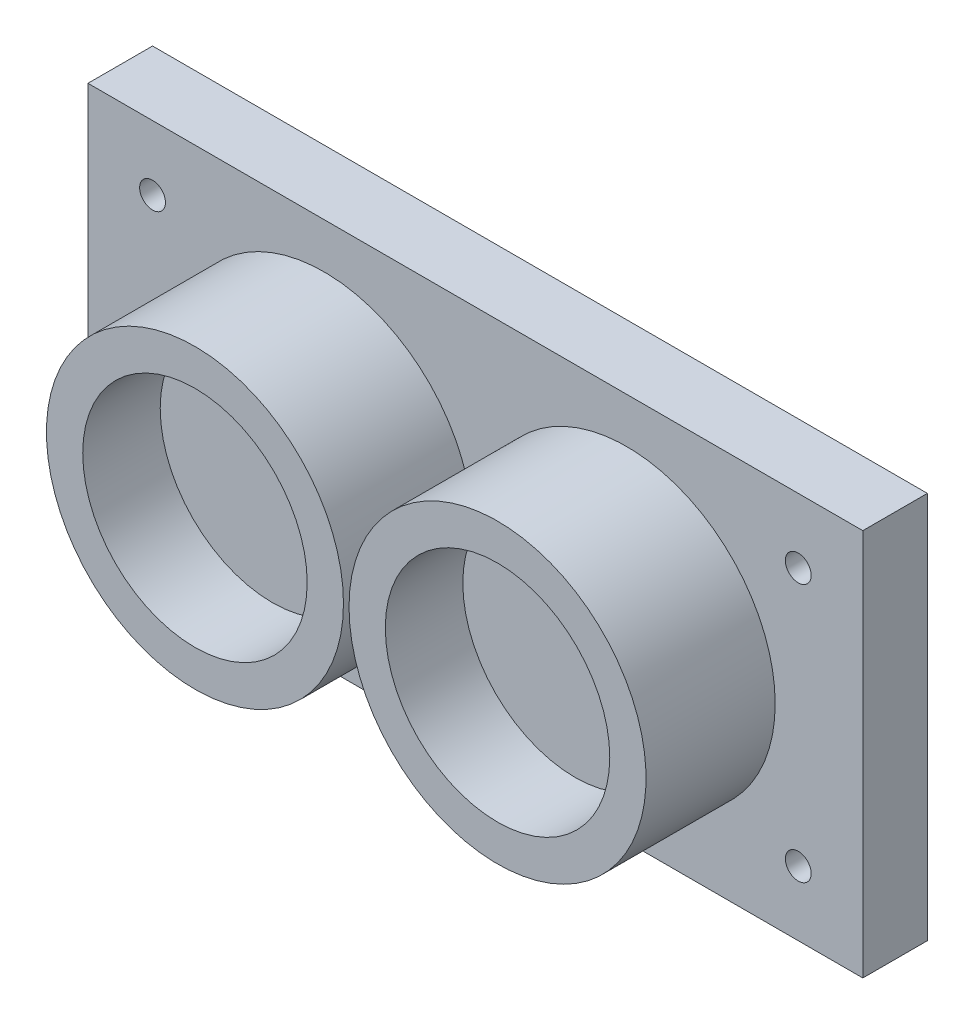
ISO-10303-21;
HEADER;
FILE_DESCRIPTION(('STEP AP214'),'2;1');
FILE_NAME('part.step','',(''),(''),'','','');
FILE_SCHEMA(('AUTOMOTIVE_DESIGN { 1 0 10303 214 1 1 1 1 }'));
ENDSEC;
DATA;
#1=APPLICATION_CONTEXT('core data for automotive mechanical design processes');
#2=APPLICATION_PROTOCOL_DEFINITION('international standard','automotive_design',2000,#1);
#3=PRODUCT_CONTEXT('',#1,'mechanical');
#4=PRODUCT('Part','Part','',(#3));
#5=PRODUCT_RELATED_PRODUCT_CATEGORY('part','',(#4));
#6=PRODUCT_DEFINITION_FORMATION('','',#4);
#7=PRODUCT_DEFINITION_CONTEXT('part definition',#1,'design');
#8=PRODUCT_DEFINITION('design','',#6,#7);
#9=PRODUCT_DEFINITION_SHAPE('','',#8);
#10=(LENGTH_UNIT() NAMED_UNIT(*) SI_UNIT(.MILLI.,.METRE.));
#11=(NAMED_UNIT(*) PLANE_ANGLE_UNIT() SI_UNIT($,.RADIAN.));
#12=(NAMED_UNIT(*) SI_UNIT($,.STERADIAN.) SOLID_ANGLE_UNIT());
#13=UNCERTAINTY_MEASURE_WITH_UNIT(LENGTH_MEASURE(1.E-05),#10,'distance_accuracy_value','');
#14=(GEOMETRIC_REPRESENTATION_CONTEXT(3) GLOBAL_UNCERTAINTY_ASSIGNED_CONTEXT((#13)) GLOBAL_UNIT_ASSIGNED_CONTEXT((#10,
#11,#12)) REPRESENTATION_CONTEXT('',''));
#15=CARTESIAN_POINT('',(0.,0.,0.));
#16=DIRECTION('',(0.,0.,1.));
#17=DIRECTION('',(1.,0.,0.));
#18=AXIS2_PLACEMENT_3D('',#15,#16,#17);
#19=CARTESIAN_POINT('',(0.,0.,5.));
#20=DIRECTION('',(0.,0.,1.));
#21=DIRECTION('',(1.,0.,0.));
#22=AXIS2_PLACEMENT_3D('',#19,#20,#21);
#23=PLANE('',#22);
#24=CARTESIAN_POINT('',(25.,10.,5.));
#25=DIRECTION('',(0.,0.,-1.));
#26=DIRECTION('',(-1.,0.,0.));
#27=AXIS2_PLACEMENT_3D('',#24,#25,#26);
#28=CIRCLE('',#27,1.);
#29=CARTESIAN_POINT('',(24.,10.,5.));
#30=VERTEX_POINT('',#29);
#31=EDGE_CURVE('E240',#30,#30,#28,.T.);
#32=ORIENTED_EDGE('',*,*,#31,.T.);
#33=EDGE_LOOP('',(#32));
#34=FACE_BOUND('',#33,.T.);
#35=CARTESIAN_POINT('',(25.,-10.,5.));
#36=DIRECTION('',(0.,0.,1.));
#37=DIRECTION('',(1.,0.,0.));
#38=AXIS2_PLACEMENT_3D('',#35,#36,#37);
#39=CIRCLE('',#38,1.);
#40=CARTESIAN_POINT('',(26.,-10.,5.));
#41=VERTEX_POINT('',#40);
#42=EDGE_CURVE('E118',#41,#41,#39,.T.);
#43=ORIENTED_EDGE('',*,*,#42,.F.);
#44=EDGE_LOOP('',(#43));
#45=FACE_BOUND('',#44,.T.);
#46=CARTESIAN_POINT('',(11.715,0.,5.));
#47=DIRECTION('',(0.,0.,1.));
#48=DIRECTION('',(1.,0.,0.));
#49=AXIS2_PLACEMENT_3D('',#46,#47,#48);
#50=CIRCLE('',#49,11.5);
#51=CARTESIAN_POINT('',(23.215,0.,5.));
#52=VERTEX_POINT('',#51);
#53=EDGE_CURVE('E11',#52,#52,#50,.T.);
#54=ORIENTED_EDGE('',*,*,#53,.F.);
#55=EDGE_LOOP('',(#54));
#56=FACE_BOUND('',#55,.T.);
#57=CARTESIAN_POINT('',(-11.715,0.,5.));
#58=DIRECTION('',(0.,0.,1.));
#59=DIRECTION('',(1.,0.,0.));
#60=AXIS2_PLACEMENT_3D('',#57,#58,#59);
#61=CIRCLE('',#60,11.5);
#62=CARTESIAN_POINT('',(-0.214999999999996,0.,5.));
#63=VERTEX_POINT('',#62);
#64=EDGE_CURVE('E141',#63,#63,#61,.T.);
#65=ORIENTED_EDGE('',*,*,#64,.F.);
#66=EDGE_LOOP('',(#65));
#67=FACE_BOUND('',#66,.T.);
#68=DIRECTION('',(0.,-1.,0.));
#69=VECTOR('',#68,1.);
#70=CARTESIAN_POINT('',(-30.,-15.,5.));
#71=LINE('',#70,#69);
#72=CARTESIAN_POINT('',(-30.,15.,5.));
#73=VERTEX_POINT('',#72);
#74=CARTESIAN_POINT('',(-30.,-15.,5.));
#75=VERTEX_POINT('',#74);
#76=EDGE_CURVE('E90',#73,#75,#71,.T.);
#77=ORIENTED_EDGE('',*,*,#76,.T.);
#78=DIRECTION('',(1.,0.,0.));
#79=VECTOR('',#78,1.);
#80=CARTESIAN_POINT('',(30.,-15.,5.));
#81=LINE('',#80,#79);
#82=CARTESIAN_POINT('',(30.,-15.,5.));
#83=VERTEX_POINT('',#82);
#84=EDGE_CURVE('E85',#75,#83,#81,.T.);
#85=ORIENTED_EDGE('',*,*,#84,.T.);
#86=DIRECTION('',(0.,1.,0.));
#87=VECTOR('',#86,1.);
#88=CARTESIAN_POINT('',(30.,-15.,5.));
#89=LINE('',#88,#87);
#90=CARTESIAN_POINT('',(30.,15.,5.));
#91=VERTEX_POINT('',#90);
#92=EDGE_CURVE('E88',#83,#91,#89,.T.);
#93=ORIENTED_EDGE('',*,*,#92,.T.);
#94=DIRECTION('',(-1.,0.,0.));
#95=VECTOR('',#94,1.);
#96=CARTESIAN_POINT('',(30.,15.,5.));
#97=LINE('',#96,#95);
#98=EDGE_CURVE('E54',#91,#73,#97,.T.);
#99=ORIENTED_EDGE('',*,*,#98,.T.);
#100=EDGE_LOOP('',(#77,#85,#93,#99));
#101=FACE_BOUND('',#100,.T.);
#102=CARTESIAN_POINT('',(-25.,10.,5.));
#103=DIRECTION('',(0.,0.,1.));
#104=DIRECTION('',(1.,0.,0.));
#105=AXIS2_PLACEMENT_3D('',#102,#103,#104);
#106=CIRCLE('',#105,1.);
#107=CARTESIAN_POINT('',(-24.,10.,5.));
#108=VERTEX_POINT('',#107);
#109=EDGE_CURVE('E244',#108,#108,#106,.T.);
#110=ORIENTED_EDGE('',*,*,#109,.F.);
#111=EDGE_LOOP('',(#110));
#112=FACE_BOUND('',#111,.T.);
#113=CARTESIAN_POINT('',(-25.,-10.,5.));
#114=DIRECTION('',(0.,0.,-1.));
#115=DIRECTION('',(-1.,0.,0.));
#116=AXIS2_PLACEMENT_3D('',#113,#114,#115);
#117=CIRCLE('',#116,1.);
#118=CARTESIAN_POINT('',(-26.,-10.,5.));
#119=VERTEX_POINT('',#118);
#120=EDGE_CURVE('E241',#119,#119,#117,.T.);
#121=ORIENTED_EDGE('',*,*,#120,.T.);
#122=EDGE_LOOP('',(#121));
#123=FACE_BOUND('',#122,.T.);
#124=ADVANCED_FACE('F35',(#34,#45,#56,#67,#101,#112,#123),#23,.T.);
#125=CARTESIAN_POINT('',(0.,0.,0.));
#126=DIRECTION('',(0.,0.,1.));
#127=DIRECTION('',(1.,0.,0.));
#128=AXIS2_PLACEMENT_3D('',#125,#126,#127);
#129=PLANE('',#128);
#130=CARTESIAN_POINT('',(-25.,10.,0.));
#131=DIRECTION('',(0.,0.,1.));
#132=DIRECTION('',(1.,0.,0.));
#133=AXIS2_PLACEMENT_3D('',#130,#131,#132);
#134=CIRCLE('',#133,1.);
#135=CARTESIAN_POINT('',(-24.,10.,0.));
#136=VERTEX_POINT('',#135);
#137=EDGE_CURVE('E120',#136,#136,#134,.T.);
#138=ORIENTED_EDGE('',*,*,#137,.T.);
#139=EDGE_LOOP('',(#138));
#140=FACE_BOUND('',#139,.T.);
#141=CARTESIAN_POINT('',(25.,-10.,0.));
#142=DIRECTION('',(0.,0.,1.));
#143=DIRECTION('',(1.,0.,0.));
#144=AXIS2_PLACEMENT_3D('',#141,#142,#143);
#145=CIRCLE('',#144,1.);
#146=CARTESIAN_POINT('',(26.,-10.,0.));
#147=VERTEX_POINT('',#146);
#148=EDGE_CURVE('E114',#147,#147,#145,.T.);
#149=ORIENTED_EDGE('',*,*,#148,.T.);
#150=EDGE_LOOP('',(#149));
#151=FACE_BOUND('',#150,.T.);
#152=DIRECTION('',(0.,-1.,0.));
#153=VECTOR('',#152,1.);
#154=CARTESIAN_POINT('',(-30.,-15.,0.));
#155=LINE('',#154,#153);
#156=CARTESIAN_POINT('',(-30.,15.,0.));
#157=VERTEX_POINT('',#156);
#158=CARTESIAN_POINT('',(-30.,-15.,0.));
#159=VERTEX_POINT('',#158);
#160=EDGE_CURVE('E104',#157,#159,#155,.T.);
#161=ORIENTED_EDGE('',*,*,#160,.F.);
#162=DIRECTION('',(-1.,0.,0.));
#163=VECTOR('',#162,1.);
#164=CARTESIAN_POINT('',(30.,15.,0.));
#165=LINE('',#164,#163);
#166=CARTESIAN_POINT('',(30.,15.,0.));
#167=VERTEX_POINT('',#166);
#168=EDGE_CURVE('E77',#167,#157,#165,.T.);
#169=ORIENTED_EDGE('',*,*,#168,.F.);
#170=DIRECTION('',(0.,1.,0.));
#171=VECTOR('',#170,1.);
#172=CARTESIAN_POINT('',(30.,-15.,0.));
#173=LINE('',#172,#171);
#174=CARTESIAN_POINT('',(30.,-15.,0.));
#175=VERTEX_POINT('',#174);
#176=EDGE_CURVE('E71',#175,#167,#173,.T.);
#177=ORIENTED_EDGE('',*,*,#176,.F.);
#178=DIRECTION('',(1.,0.,0.));
#179=VECTOR('',#178,1.);
#180=CARTESIAN_POINT('',(30.,-15.,0.));
#181=LINE('',#180,#179);
#182=EDGE_CURVE('E95',#159,#175,#181,.T.);
#183=ORIENTED_EDGE('',*,*,#182,.F.);
#184=EDGE_LOOP('',(#161,#169,#177,#183));
#185=FACE_BOUND('',#184,.T.);
#186=CARTESIAN_POINT('',(25.,10.,0.));
#187=DIRECTION('',(0.,0.,1.));
#188=DIRECTION('',(1.,0.,0.));
#189=AXIS2_PLACEMENT_3D('',#186,#187,#188);
#190=CIRCLE('',#189,1.);
#191=CARTESIAN_POINT('',(26.,10.,0.));
#192=VERTEX_POINT('',#191);
#193=EDGE_CURVE('E117',#192,#192,#190,.F.);
#194=ORIENTED_EDGE('',*,*,#193,.F.);
#195=EDGE_LOOP('',(#194));
#196=FACE_BOUND('',#195,.T.);
#197=CARTESIAN_POINT('',(-25.,-10.,0.));
#198=DIRECTION('',(0.,0.,1.));
#199=DIRECTION('',(1.,0.,0.));
#200=AXIS2_PLACEMENT_3D('',#197,#198,#199);
#201=CIRCLE('',#200,1.);
#202=CARTESIAN_POINT('',(-24.,-10.,0.));
#203=VERTEX_POINT('',#202);
#204=EDGE_CURVE('E39',#203,#203,#201,.F.);
#205=ORIENTED_EDGE('',*,*,#204,.F.);
#206=EDGE_LOOP('',(#205));
#207=FACE_BOUND('',#206,.T.);
#208=ADVANCED_FACE('F151',(#140,#151,#185,#196,#207),#129,.F.);
#209=CARTESIAN_POINT('',(-30.,-15.,5.));
#210=DIRECTION('',(1.,0.,0.));
#211=DIRECTION('',(0.,0.,-1.));
#212=AXIS2_PLACEMENT_3D('',#209,#210,#211);
#213=PLANE('',#212);
#214=ORIENTED_EDGE('',*,*,#160,.T.);
#215=DIRECTION('',(0.,0.,-1.));
#216=VECTOR('',#215,1.);
#217=CARTESIAN_POINT('',(-30.,-15.,5.));
#218=LINE('',#217,#216);
#219=EDGE_CURVE('E45',#75,#159,#218,.T.);
#220=ORIENTED_EDGE('',*,*,#219,.F.);
#221=ORIENTED_EDGE('',*,*,#76,.F.);
#222=DIRECTION('',(0.,0.,-1.));
#223=VECTOR('',#222,1.);
#224=CARTESIAN_POINT('',(-30.,15.,5.));
#225=LINE('',#224,#223);
#226=EDGE_CURVE('E100',#73,#157,#225,.T.);
#227=ORIENTED_EDGE('',*,*,#226,.T.);
#228=EDGE_LOOP('',(#214,#220,#221,#227));
#229=FACE_BOUND('',#228,.T.);
#230=ADVANCED_FACE('F37',(#229),#213,.F.);
#231=CARTESIAN_POINT('',(30.,-15.,5.));
#232=DIRECTION('',(0.,1.,0.));
#233=DIRECTION('',(-1.,0.,0.));
#234=AXIS2_PLACEMENT_3D('',#231,#232,#233);
#235=PLANE('',#234);
#236=ORIENTED_EDGE('',*,*,#182,.T.);
#237=DIRECTION('',(0.,0.,-1.));
#238=VECTOR('',#237,1.);
#239=CARTESIAN_POINT('',(30.,-15.,5.));
#240=LINE('',#239,#238);
#241=EDGE_CURVE('E93',#83,#175,#240,.T.);
#242=ORIENTED_EDGE('',*,*,#241,.F.);
#243=ORIENTED_EDGE('',*,*,#84,.F.);
#244=ORIENTED_EDGE('',*,*,#219,.T.);
#245=EDGE_LOOP('',(#236,#242,#243,#244));
#246=FACE_BOUND('',#245,.T.);
#247=ADVANCED_FACE('F94',(#246),#235,.F.);
#248=CARTESIAN_POINT('',(30.,-15.,5.));
#249=DIRECTION('',(-1.,0.,0.));
#250=DIRECTION('',(0.,0.,1.));
#251=AXIS2_PLACEMENT_3D('',#248,#249,#250);
#252=PLANE('',#251);
#253=ORIENTED_EDGE('',*,*,#176,.T.);
#254=DIRECTION('',(0.,0.,-1.));
#255=VECTOR('',#254,1.);
#256=CARTESIAN_POINT('',(30.,15.,5.));
#257=LINE('',#256,#255);
#258=EDGE_CURVE('E96',#91,#167,#257,.T.);
#259=ORIENTED_EDGE('',*,*,#258,.F.);
#260=ORIENTED_EDGE('',*,*,#92,.F.);
#261=ORIENTED_EDGE('',*,*,#241,.T.);
#262=EDGE_LOOP('',(#253,#259,#260,#261));
#263=FACE_BOUND('',#262,.T.);
#264=ADVANCED_FACE('F98',(#263),#252,.F.);
#265=CARTESIAN_POINT('',(30.,15.,5.));
#266=DIRECTION('',(0.,-1.,0.));
#267=DIRECTION('',(1.,0.,0.));
#268=AXIS2_PLACEMENT_3D('',#265,#266,#267);
#269=PLANE('',#268);
#270=ORIENTED_EDGE('',*,*,#168,.T.);
#271=ORIENTED_EDGE('',*,*,#226,.F.);
#272=ORIENTED_EDGE('',*,*,#98,.F.);
#273=ORIENTED_EDGE('',*,*,#258,.T.);
#274=EDGE_LOOP('',(#270,#271,#272,#273));
#275=FACE_BOUND('',#274,.T.);
#276=ADVANCED_FACE('F163',(#275),#269,.F.);
#277=CARTESIAN_POINT('',(-11.715,0.,15.));
#278=DIRECTION('',(0.,0.,-1.));
#279=DIRECTION('',(-1.,0.,0.));
#280=AXIS2_PLACEMENT_3D('',#277,#278,#279);
#281=CYLINDRICAL_SURFACE('',#280,11.5);
#282=CARTESIAN_POINT('',(-11.715,0.,15.));
#283=DIRECTION('',(0.,0.,1.));
#284=DIRECTION('',(1.,0.,0.));
#285=AXIS2_PLACEMENT_3D('',#282,#283,#284);
#286=CIRCLE('',#285,11.5);
#287=CARTESIAN_POINT('',(-0.214999999999996,0.,15.));
#288=VERTEX_POINT('',#287);
#289=EDGE_CURVE('E107',#288,#288,#286,.T.);
#290=ORIENTED_EDGE('',*,*,#289,.F.);
#291=EDGE_LOOP('',(#290));
#292=FACE_BOUND('',#291,.T.);
#293=ORIENTED_EDGE('',*,*,#64,.T.);
#294=EDGE_LOOP('',(#293));
#295=FACE_BOUND('',#294,.T.);
#296=ADVANCED_FACE('F148',(#292,#295),#281,.T.);
#297=CARTESIAN_POINT('',(-11.715,0.,15.));
#298=DIRECTION('',(0.,0.,1.));
#299=DIRECTION('',(1.,0.,0.));
#300=AXIS2_PLACEMENT_3D('',#297,#298,#299);
#301=PLANE('',#300);
#302=CARTESIAN_POINT('',(-11.715,0.,15.));
#303=DIRECTION('',(0.,0.,1.));
#304=DIRECTION('',(1.,0.,0.));
#305=AXIS2_PLACEMENT_3D('',#302,#303,#304);
#306=CIRCLE('',#305,8.69);
#307=CARTESIAN_POINT('',(-3.025,0.,15.));
#308=VERTEX_POINT('',#307);
#309=EDGE_CURVE('E134',#308,#308,#306,.T.);
#310=ORIENTED_EDGE('',*,*,#309,.F.);
#311=EDGE_LOOP('',(#310));
#312=FACE_BOUND('',#311,.T.);
#313=ORIENTED_EDGE('',*,*,#289,.T.);
#314=EDGE_LOOP('',(#313));
#315=FACE_BOUND('',#314,.T.);
#316=ADVANCED_FACE('F220',(#312,#315),#301,.T.);
#317=CARTESIAN_POINT('',(11.715,0.,15.));
#318=DIRECTION('',(0.,0.,-1.));
#319=DIRECTION('',(-1.,0.,0.));
#320=AXIS2_PLACEMENT_3D('',#317,#318,#319);
#321=CYLINDRICAL_SURFACE('',#320,11.5);
#322=CARTESIAN_POINT('',(11.715,0.,15.));
#323=DIRECTION('',(0.,0.,-1.));
#324=DIRECTION('',(-1.,0.,0.));
#325=AXIS2_PLACEMENT_3D('',#322,#323,#324);
#326=CIRCLE('',#325,11.5);
#327=CARTESIAN_POINT('',(0.215000000000005,0.,15.));
#328=VERTEX_POINT('',#327);
#329=EDGE_CURVE('E138',#328,#328,#326,.T.);
#330=ORIENTED_EDGE('',*,*,#329,.T.);
#331=EDGE_LOOP('',(#330));
#332=FACE_BOUND('',#331,.T.);
#333=ORIENTED_EDGE('',*,*,#53,.T.);
#334=EDGE_LOOP('',(#333));
#335=FACE_BOUND('',#334,.T.);
#336=ADVANCED_FACE('F217',(#332,#335),#321,.T.);
#337=CARTESIAN_POINT('',(11.715,0.,15.));
#338=DIRECTION('',(0.,0.,-1.));
#339=DIRECTION('',(-1.,0.,0.));
#340=AXIS2_PLACEMENT_3D('',#337,#338,#339);
#341=PLANE('',#340);
#342=CARTESIAN_POINT('',(11.715,0.,15.));
#343=DIRECTION('',(0.,0.,1.));
#344=DIRECTION('',(1.,0.,0.));
#345=AXIS2_PLACEMENT_3D('',#342,#343,#344);
#346=CIRCLE('',#345,8.69);
#347=CARTESIAN_POINT('',(20.405,0.,15.));
#348=VERTEX_POINT('',#347);
#349=EDGE_CURVE('E125',#348,#348,#346,.T.);
#350=ORIENTED_EDGE('',*,*,#349,.F.);
#351=EDGE_LOOP('',(#350));
#352=FACE_BOUND('',#351,.T.);
#353=ORIENTED_EDGE('',*,*,#329,.F.);
#354=EDGE_LOOP('',(#353));
#355=FACE_BOUND('',#354,.T.);
#356=ADVANCED_FACE('F215',(#352,#355),#341,.F.);
#357=CARTESIAN_POINT('',(11.715,0.,9.));
#358=DIRECTION('',(0.,0.,1.));
#359=DIRECTION('',(1.,0.,0.));
#360=AXIS2_PLACEMENT_3D('',#357,#358,#359);
#361=CYLINDRICAL_SURFACE('',#360,8.69);
#362=CARTESIAN_POINT('',(11.715,0.,9.));
#363=DIRECTION('',(0.,0.,1.));
#364=DIRECTION('',(1.,0.,0.));
#365=AXIS2_PLACEMENT_3D('',#362,#363,#364);
#366=CIRCLE('',#365,8.69);
#367=CARTESIAN_POINT('',(20.405,0.,9.));
#368=VERTEX_POINT('',#367);
#369=EDGE_CURVE('E129',#368,#368,#366,.T.);
#370=ORIENTED_EDGE('',*,*,#369,.F.);
#371=EDGE_LOOP('',(#370));
#372=FACE_BOUND('',#371,.T.);
#373=ORIENTED_EDGE('',*,*,#349,.T.);
#374=EDGE_LOOP('',(#373));
#375=FACE_BOUND('',#374,.T.);
#376=ADVANCED_FACE('F211',(#372,#375),#361,.F.);
#377=CARTESIAN_POINT('',(11.715,0.,9.));
#378=DIRECTION('',(0.,0.,1.));
#379=DIRECTION('',(1.,0.,0.));
#380=AXIS2_PLACEMENT_3D('',#377,#378,#379);
#381=PLANE('',#380);
#382=ORIENTED_EDGE('',*,*,#369,.T.);
#383=EDGE_LOOP('',(#382));
#384=FACE_BOUND('',#383,.T.);
#385=ADVANCED_FACE('F207',(#384),#381,.T.);
#386=CARTESIAN_POINT('',(-11.715,0.,9.));
#387=DIRECTION('',(0.,0.,1.));
#388=DIRECTION('',(1.,0.,0.));
#389=AXIS2_PLACEMENT_3D('',#386,#387,#388);
#390=CYLINDRICAL_SURFACE('',#389,8.69);
#391=CARTESIAN_POINT('',(-11.715,0.,9.));
#392=DIRECTION('',(0.,0.,1.));
#393=DIRECTION('',(1.,0.,0.));
#394=AXIS2_PLACEMENT_3D('',#391,#392,#393);
#395=CIRCLE('',#394,8.69);
#396=CARTESIAN_POINT('',(-3.025,0.,9.));
#397=VERTEX_POINT('',#396);
#398=EDGE_CURVE('E142',#397,#397,#395,.T.);
#399=ORIENTED_EDGE('',*,*,#398,.F.);
#400=EDGE_LOOP('',(#399));
#401=FACE_BOUND('',#400,.T.);
#402=ORIENTED_EDGE('',*,*,#309,.T.);
#403=EDGE_LOOP('',(#402));
#404=FACE_BOUND('',#403,.T.);
#405=ADVANCED_FACE('F203',(#401,#404),#390,.F.);
#406=CARTESIAN_POINT('',(-11.715,0.,9.));
#407=DIRECTION('',(0.,0.,1.));
#408=DIRECTION('',(1.,0.,0.));
#409=AXIS2_PLACEMENT_3D('',#406,#407,#408);
#410=PLANE('',#409);
#411=ORIENTED_EDGE('',*,*,#398,.T.);
#412=EDGE_LOOP('',(#411));
#413=FACE_BOUND('',#412,.T.);
#414=ADVANCED_FACE('F193',(#413),#410,.T.);
#415=CARTESIAN_POINT('',(25.,-10.,-5.));
#416=DIRECTION('',(0.,0.,1.));
#417=DIRECTION('',(1.,0.,0.));
#418=AXIS2_PLACEMENT_3D('',#415,#416,#417);
#419=CYLINDRICAL_SURFACE('',#418,1.);
#420=ORIENTED_EDGE('',*,*,#42,.T.);
#421=EDGE_LOOP('',(#420));
#422=FACE_BOUND('',#421,.T.);
#423=ORIENTED_EDGE('',*,*,#148,.F.);
#424=EDGE_LOOP('',(#423));
#425=FACE_BOUND('',#424,.T.);
#426=ADVANCED_FACE('F183',(#422,#425),#419,.F.);
#427=CARTESIAN_POINT('',(25.,10.,-5.));
#428=DIRECTION('',(0.,0.,1.));
#429=DIRECTION('',(1.,0.,0.));
#430=AXIS2_PLACEMENT_3D('',#427,#428,#429);
#431=CYLINDRICAL_SURFACE('',#430,1.);
#432=ORIENTED_EDGE('',*,*,#31,.F.);
#433=EDGE_LOOP('',(#432));
#434=FACE_BOUND('',#433,.T.);
#435=ORIENTED_EDGE('',*,*,#193,.T.);
#436=EDGE_LOOP('',(#435));
#437=FACE_BOUND('',#436,.T.);
#438=ADVANCED_FACE('F180',(#434,#437),#431,.F.);
#439=CARTESIAN_POINT('',(-25.,10.,-5.));
#440=DIRECTION('',(0.,0.,1.));
#441=DIRECTION('',(1.,0.,0.));
#442=AXIS2_PLACEMENT_3D('',#439,#440,#441);
#443=CYLINDRICAL_SURFACE('',#442,1.);
#444=ORIENTED_EDGE('',*,*,#109,.T.);
#445=EDGE_LOOP('',(#444));
#446=FACE_BOUND('',#445,.T.);
#447=ORIENTED_EDGE('',*,*,#137,.F.);
#448=EDGE_LOOP('',(#447));
#449=FACE_BOUND('',#448,.T.);
#450=ADVANCED_FACE('F182',(#446,#449),#443,.F.);
#451=CARTESIAN_POINT('',(-25.,-10.,-5.));
#452=DIRECTION('',(0.,0.,1.));
#453=DIRECTION('',(1.,0.,0.));
#454=AXIS2_PLACEMENT_3D('',#451,#452,#453);
#455=CYLINDRICAL_SURFACE('',#454,1.);
#456=ORIENTED_EDGE('',*,*,#120,.F.);
#457=EDGE_LOOP('',(#456));
#458=FACE_BOUND('',#457,.T.);
#459=ORIENTED_EDGE('',*,*,#204,.T.);
#460=EDGE_LOOP('',(#459));
#461=FACE_BOUND('',#460,.T.);
#462=ADVANCED_FACE('F190',(#458,#461),#455,.F.);
#463=CLOSED_SHELL('',(#124,#208,#230,#247,#264,#276,#296,#316,#336,#356,#376,#385,#405,#414,
#426,#438,#450,#462));
#464=MANIFOLD_SOLID_BREP('B2',#463);
#465=ADVANCED_BREP_SHAPE_REPRESENTATION('',(#18,#464),#14);
#466=SHAPE_DEFINITION_REPRESENTATION(#9,#465);
ENDSEC;
END-ISO-10303-21;
